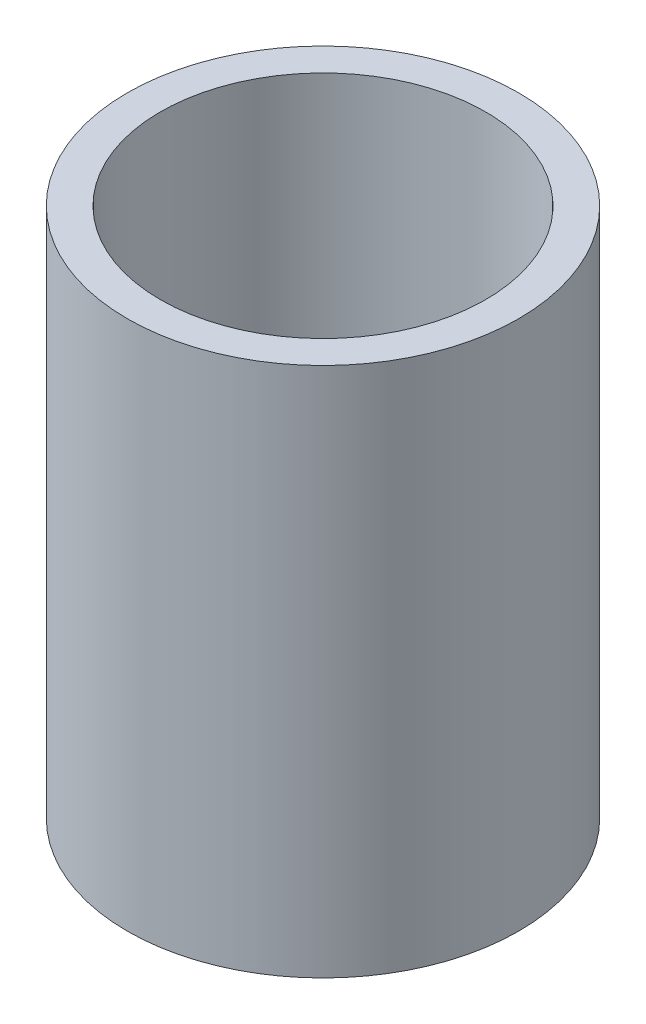
ISO-10303-21;
HEADER;
FILE_DESCRIPTION(('STEP AP214'),'2;1');
FILE_NAME('part.step','',(''),(''),'','','');
FILE_SCHEMA(('AUTOMOTIVE_DESIGN { 1 0 10303 214 1 1 1 1 }'));
ENDSEC;
DATA;
#1=APPLICATION_CONTEXT('core data for automotive mechanical design processes');
#2=APPLICATION_PROTOCOL_DEFINITION('international standard','automotive_design',2000,#1);
#3=PRODUCT_CONTEXT('',#1,'mechanical');
#4=PRODUCT('Part','Part','',(#3));
#5=PRODUCT_RELATED_PRODUCT_CATEGORY('part','',(#4));
#6=PRODUCT_DEFINITION_FORMATION('','',#4);
#7=PRODUCT_DEFINITION_CONTEXT('part definition',#1,'design');
#8=PRODUCT_DEFINITION('design','',#6,#7);
#9=PRODUCT_DEFINITION_SHAPE('','',#8);
#10=(LENGTH_UNIT() NAMED_UNIT(*) SI_UNIT(.MILLI.,.METRE.));
#11=(NAMED_UNIT(*) PLANE_ANGLE_UNIT() SI_UNIT($,.RADIAN.));
#12=(NAMED_UNIT(*) SI_UNIT($,.STERADIAN.) SOLID_ANGLE_UNIT());
#13=UNCERTAINTY_MEASURE_WITH_UNIT(LENGTH_MEASURE(1.E-05),#10,'distance_accuracy_value','');
#14=(GEOMETRIC_REPRESENTATION_CONTEXT(3) GLOBAL_UNCERTAINTY_ASSIGNED_CONTEXT((#13)) GLOBAL_UNIT_ASSIGNED_CONTEXT((#10,
#11,#12)) REPRESENTATION_CONTEXT('',''));
#15=CARTESIAN_POINT('',(0.,0.,0.));
#16=DIRECTION('',(0.,0.,1.));
#17=DIRECTION('',(1.,0.,0.));
#18=AXIS2_PLACEMENT_3D('',#15,#16,#17);
#19=CARTESIAN_POINT('',(0.,57.15,0.));
#20=DIRECTION('',(0.,1.,0.));
#21=DIRECTION('',(0.,0.,1.));
#22=AXIS2_PLACEMENT_3D('',#19,#20,#21);
#23=PLANE('',#22);
#24=CARTESIAN_POINT('',(0.,57.15,0.));
#25=DIRECTION('',(0.,1.,0.));
#26=DIRECTION('',(0.,0.,1.));
#27=AXIS2_PLACEMENT_3D('',#24,#25,#26);
#28=CIRCLE('',#27,21.082);
#29=CARTESIAN_POINT('',(0.,57.15,21.082));
#30=VERTEX_POINT('',#29);
#31=EDGE_CURVE('E10',#30,#30,#28,.T.);
#32=ORIENTED_EDGE('',*,*,#31,.T.);
#33=EDGE_LOOP('',(#32));
#34=FACE_BOUND('',#33,.T.);
#35=CARTESIAN_POINT('',(0.,57.15,0.));
#36=DIRECTION('',(0.,1.,0.));
#37=DIRECTION('',(0.,0.,1.));
#38=AXIS2_PLACEMENT_3D('',#35,#36,#37);
#39=CIRCLE('',#38,17.526);
#40=CARTESIAN_POINT('',(0.,57.15,17.526));
#41=VERTEX_POINT('',#40);
#42=EDGE_CURVE('E53',#41,#41,#39,.T.);
#43=ORIENTED_EDGE('',*,*,#42,.F.);
#44=EDGE_LOOP('',(#43));
#45=FACE_BOUND('',#44,.T.);
#46=ADVANCED_FACE('F39',(#34,#45),#23,.T.);
#47=CARTESIAN_POINT('',(0.,0.,0.));
#48=DIRECTION('',(0.,1.,0.));
#49=DIRECTION('',(0.,0.,1.));
#50=AXIS2_PLACEMENT_3D('',#47,#48,#49);
#51=PLANE('',#50);
#52=CARTESIAN_POINT('',(0.,0.,0.));
#53=DIRECTION('',(0.,1.,0.));
#54=DIRECTION('',(0.,0.,1.));
#55=AXIS2_PLACEMENT_3D('',#52,#53,#54);
#56=CIRCLE('',#55,21.082);
#57=CARTESIAN_POINT('',(0.,0.,21.082));
#58=VERTEX_POINT('',#57);
#59=EDGE_CURVE('E43',#58,#58,#56,.T.);
#60=ORIENTED_EDGE('',*,*,#59,.F.);
#61=EDGE_LOOP('',(#60));
#62=FACE_BOUND('',#61,.T.);
#63=CARTESIAN_POINT('',(0.,0.,0.));
#64=DIRECTION('',(0.,1.,0.));
#65=DIRECTION('',(0.,0.,1.));
#66=AXIS2_PLACEMENT_3D('',#63,#64,#65);
#67=CIRCLE('',#66,17.526);
#68=CARTESIAN_POINT('',(0.,0.,17.526));
#69=VERTEX_POINT('',#68);
#70=EDGE_CURVE('E55',#69,#69,#67,.T.);
#71=ORIENTED_EDGE('',*,*,#70,.T.);
#72=EDGE_LOOP('',(#71));
#73=FACE_BOUND('',#72,.T.);
#74=ADVANCED_FACE('F68',(#62,#73),#51,.F.);
#75=CARTESIAN_POINT('',(0.,57.15,0.));
#76=DIRECTION('',(0.,-1.,0.));
#77=DIRECTION('',(0.,0.,-1.));
#78=AXIS2_PLACEMENT_3D('',#75,#76,#77);
#79=CYLINDRICAL_SURFACE('',#78,21.082);
#80=ORIENTED_EDGE('',*,*,#31,.F.);
#81=EDGE_LOOP('',(#80));
#82=FACE_BOUND('',#81,.T.);
#83=ORIENTED_EDGE('',*,*,#59,.T.);
#84=EDGE_LOOP('',(#83));
#85=FACE_BOUND('',#84,.T.);
#86=ADVANCED_FACE('F41',(#82,#85),#79,.T.);
#87=CARTESIAN_POINT('',(0.,57.15,0.));
#88=DIRECTION('',(0.,-1.,0.));
#89=DIRECTION('',(0.,0.,-1.));
#90=AXIS2_PLACEMENT_3D('',#87,#88,#89);
#91=CYLINDRICAL_SURFACE('',#90,17.526);
#92=ORIENTED_EDGE('',*,*,#42,.T.);
#93=EDGE_LOOP('',(#92));
#94=FACE_BOUND('',#93,.T.);
#95=ORIENTED_EDGE('',*,*,#70,.F.);
#96=EDGE_LOOP('',(#95));
#97=FACE_BOUND('',#96,.T.);
#98=ADVANCED_FACE('F64',(#94,#97),#91,.F.);
#99=CLOSED_SHELL('',(#46,#74,#86,#98));
#100=MANIFOLD_SOLID_BREP('B2',#99);
#101=ADVANCED_BREP_SHAPE_REPRESENTATION('',(#18,#100),#14);
#102=SHAPE_DEFINITION_REPRESENTATION(#9,#101);
ENDSEC;
END-ISO-10303-21;
